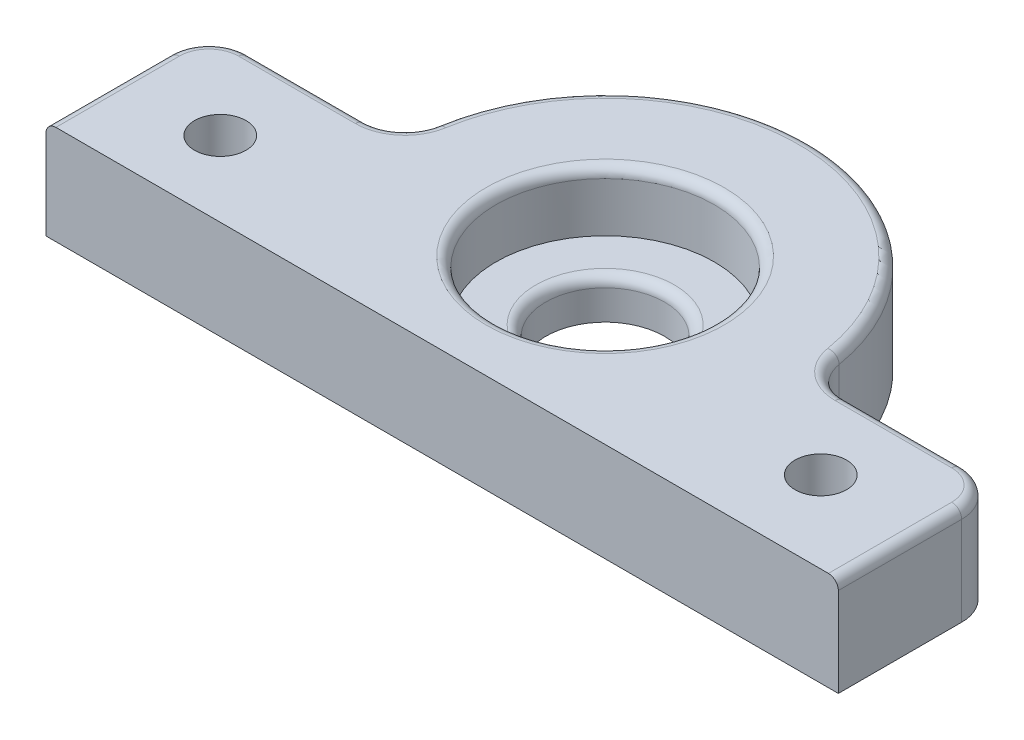
ISO-10303-21;
HEADER;
FILE_DESCRIPTION(('STEP AP214'),'2;1');
FILE_NAME('part.step','',(''),(''),'','','');
FILE_SCHEMA(('AUTOMOTIVE_DESIGN { 1 0 10303 214 1 1 1 1 }'));
ENDSEC;
DATA;
#1=APPLICATION_CONTEXT('core data for automotive mechanical design processes');
#2=APPLICATION_PROTOCOL_DEFINITION('international standard','automotive_design',2000,#1);
#3=PRODUCT_CONTEXT('',#1,'mechanical');
#4=PRODUCT('Part','Part','',(#3));
#5=PRODUCT_RELATED_PRODUCT_CATEGORY('part','',(#4));
#6=PRODUCT_DEFINITION_FORMATION('','',#4);
#7=PRODUCT_DEFINITION_CONTEXT('part definition',#1,'design');
#8=PRODUCT_DEFINITION('design','',#6,#7);
#9=PRODUCT_DEFINITION_SHAPE('','',#8);
#10=(LENGTH_UNIT() NAMED_UNIT(*) SI_UNIT(.MILLI.,.METRE.));
#11=(NAMED_UNIT(*) PLANE_ANGLE_UNIT() SI_UNIT($,.RADIAN.));
#12=(NAMED_UNIT(*) SI_UNIT($,.STERADIAN.) SOLID_ANGLE_UNIT());
#13=UNCERTAINTY_MEASURE_WITH_UNIT(LENGTH_MEASURE(1.E-05),#10,'distance_accuracy_value','');
#14=(GEOMETRIC_REPRESENTATION_CONTEXT(3) GLOBAL_UNCERTAINTY_ASSIGNED_CONTEXT((#13)) GLOBAL_UNIT_ASSIGNED_CONTEXT((#10,
#11,#12)) REPRESENTATION_CONTEXT('',''));
#15=CARTESIAN_POINT('',(0.,0.,0.));
#16=DIRECTION('',(0.,0.,1.));
#17=DIRECTION('',(1.,0.,0.));
#18=AXIS2_PLACEMENT_3D('',#15,#16,#17);
#19=CARTESIAN_POINT('',(0.,10.,0.));
#20=DIRECTION('',(0.,-1.,0.));
#21=DIRECTION('',(0.,0.,-1.));
#22=AXIS2_PLACEMENT_3D('',#19,#20,#21);
#23=CYLINDRICAL_SURFACE('',#22,11.025);
#24=CARTESIAN_POINT('',(0.,9.,0.));
#25=DIRECTION('',(0.,1.,0.));
#26=DIRECTION('',(0.,0.,1.));
#27=AXIS2_PLACEMENT_3D('',#24,#25,#26);
#28=CIRCLE('',#27,11.025);
#29=CARTESIAN_POINT('',(0.,9.,11.025));
#30=VERTEX_POINT('',#29);
#31=EDGE_CURVE('E249',#30,#30,#28,.T.);
#32=ORIENTED_EDGE('',*,*,#31,.T.);
#33=EDGE_LOOP('',(#32));
#34=FACE_BOUND('',#33,.T.);
#35=CARTESIAN_POINT('',(0.,4.,0.));
#36=DIRECTION('',(0.,-1.,0.));
#37=DIRECTION('',(0.,0.,-1.));
#38=AXIS2_PLACEMENT_3D('',#35,#36,#37);
#39=CIRCLE('',#38,11.025);
#40=CARTESIAN_POINT('',(0.,4.,-11.025));
#41=VERTEX_POINT('',#40);
#42=EDGE_CURVE('E162',#41,#41,#39,.T.);
#43=ORIENTED_EDGE('',*,*,#42,.T.);
#44=EDGE_LOOP('',(#43));
#45=FACE_BOUND('',#44,.T.);
#46=ADVANCED_FACE('F36',(#34,#45),#23,.F.);
#47=CARTESIAN_POINT('',(0.,10.,0.));
#48=DIRECTION('',(0.,1.,0.));
#49=DIRECTION('',(0.,0.,1.));
#50=AXIS2_PLACEMENT_3D('',#47,#48,#49);
#51=PLANE('',#50);
#52=CARTESIAN_POINT('',(-29.9966400739153,10.,8.86202444078227));
#53=DIRECTION('',(0.,1.,0.));
#54=DIRECTION('',(0.,0.,1.));
#55=AXIS2_PLACEMENT_3D('',#52,#53,#54);
#56=CIRCLE('',#55,2.6);
#57=CARTESIAN_POINT('',(-29.9966400739153,10.,11.4620244407823));
#58=VERTEX_POINT('',#57);
#59=EDGE_CURVE('E605',#58,#58,#56,.F.);
#60=ORIENTED_EDGE('',*,*,#59,.T.);
#61=EDGE_LOOP('',(#60));
#62=FACE_BOUND('',#61,.T.);
#63=CARTESIAN_POINT('',(30.,10.,8.22706));
#64=DIRECTION('',(0.,1.,0.));
#65=DIRECTION('',(0.,0.,1.));
#66=AXIS2_PLACEMENT_3D('',#63,#64,#65);
#67=CIRCLE('',#66,2.6);
#68=CARTESIAN_POINT('',(30.,10.,10.82706));
#69=VERTEX_POINT('',#68);
#70=EDGE_CURVE('E292',#69,#69,#67,.F.);
#71=ORIENTED_EDGE('',*,*,#70,.T.);
#72=EDGE_LOOP('',(#71));
#73=FACE_BOUND('',#72,.T.);
#74=CARTESIAN_POINT('',(0.,10.,0.));
#75=DIRECTION('',(0.,1.,0.));
#76=DIRECTION('',(0.,0.,1.));
#77=AXIS2_PLACEMENT_3D('',#74,#75,#76);
#78=CIRCLE('',#77,12.025);
#79=CARTESIAN_POINT('',(0.,10.,12.025));
#80=VERTEX_POINT('',#79);
#81=EDGE_CURVE('E228',#80,#80,#78,.F.);
#82=ORIENTED_EDGE('',*,*,#81,.T.);
#83=EDGE_LOOP('',(#82));
#84=FACE_BOUND('',#83,.T.);
#85=DIRECTION('',(1.,0.,0.));
#86=VECTOR('',#85,1.);
#87=CARTESIAN_POINT('',(-40.,10.,16.45412));
#88=LINE('',#87,#86);
#89=CARTESIAN_POINT('',(-39.,10.,16.45412));
#90=VERTEX_POINT('',#89);
#91=CARTESIAN_POINT('',(39.,10.,16.45412));
#92=VERTEX_POINT('',#91);
#93=EDGE_CURVE('E181',#90,#92,#88,.T.);
#94=ORIENTED_EDGE('',*,*,#93,.T.);
#95=DIRECTION('',(0.,0.,-1.));
#96=VECTOR('',#95,1.);
#97=CARTESIAN_POINT('',(39.,10.,4.));
#98=LINE('',#97,#96);
#99=CARTESIAN_POINT('',(39.,10.,4.));
#100=VERTEX_POINT('',#99);
#101=EDGE_CURVE('E225',#92,#100,#98,.T.);
#102=ORIENTED_EDGE('',*,*,#101,.T.);
#103=CARTESIAN_POINT('',(36.,10.,4.));
#104=DIRECTION('',(0.,1.,0.));
#105=DIRECTION('',(0.,0.,1.));
#106=AXIS2_PLACEMENT_3D('',#103,#104,#105);
#107=CIRCLE('',#106,3.);
#108=CARTESIAN_POINT('',(36.,10.,1.));
#109=VERTEX_POINT('',#108);
#110=EDGE_CURVE('E223',#100,#109,#107,.T.);
#111=ORIENTED_EDGE('',*,*,#110,.T.);
#112=DIRECTION('',(-1.,0.,0.));
#113=VECTOR('',#112,1.);
#114=CARTESIAN_POINT('',(24.2219425315147,10.,1.));
#115=LINE('',#114,#113);
#116=CARTESIAN_POINT('',(24.2219425315147,10.,1.));
#117=VERTEX_POINT('',#116);
#118=EDGE_CURVE('E221',#109,#117,#115,.T.);
#119=ORIENTED_EDGE('',*,*,#118,.T.);
#120=CARTESIAN_POINT('',(24.2219425315147,10.,-4.));
#121=DIRECTION('',(0.,1.,0.));
#122=DIRECTION('',(0.,0.,1.));
#123=AXIS2_PLACEMENT_3D('',#120,#121,#122);
#124=CIRCLE('',#123,5.);
#125=CARTESIAN_POINT('',(19.2887566798824,10.,-3.18533604887984));
#126=VERTEX_POINT('',#125);
#127=EDGE_CURVE('E219',#117,#126,#124,.F.);
#128=ORIENTED_EDGE('',*,*,#127,.T.);
#129=CARTESIAN_POINT('',(0.,10.,0.));
#130=DIRECTION('',(0.,1.,0.));
#131=DIRECTION('',(0.,0.,1.));
#132=AXIS2_PLACEMENT_3D('',#129,#130,#131);
#133=CIRCLE('',#132,19.55);
#134=CARTESIAN_POINT('',(-19.2887566798824,10.,-3.18533604887984));
#135=VERTEX_POINT('',#134);
#136=EDGE_CURVE('E217',#126,#135,#133,.T.);
#137=ORIENTED_EDGE('',*,*,#136,.T.);
#138=CARTESIAN_POINT('',(-24.2219425315147,10.,-4.));
#139=DIRECTION('',(0.,1.,0.));
#140=DIRECTION('',(0.,0.,1.));
#141=AXIS2_PLACEMENT_3D('',#138,#139,#140);
#142=CIRCLE('',#141,5.);
#143=CARTESIAN_POINT('',(-24.2219425315147,10.,1.));
#144=VERTEX_POINT('',#143);
#145=EDGE_CURVE('E215',#135,#144,#142,.F.);
#146=ORIENTED_EDGE('',*,*,#145,.T.);
#147=DIRECTION('',(-1.,0.,0.));
#148=VECTOR('',#147,1.);
#149=CARTESIAN_POINT('',(-36.,10.,1.));
#150=LINE('',#149,#148);
#151=CARTESIAN_POINT('',(-36.,10.,1.));
#152=VERTEX_POINT('',#151);
#153=EDGE_CURVE('E213',#144,#152,#150,.T.);
#154=ORIENTED_EDGE('',*,*,#153,.T.);
#155=CARTESIAN_POINT('',(-36.,10.,4.));
#156=DIRECTION('',(0.,1.,0.));
#157=DIRECTION('',(0.,0.,1.));
#158=AXIS2_PLACEMENT_3D('',#155,#156,#157);
#159=CIRCLE('',#158,3.);
#160=CARTESIAN_POINT('',(-39.,10.,4.));
#161=VERTEX_POINT('',#160);
#162=EDGE_CURVE('E211',#152,#161,#159,.T.);
#163=ORIENTED_EDGE('',*,*,#162,.T.);
#164=DIRECTION('',(0.,0.,1.));
#165=VECTOR('',#164,1.);
#166=CARTESIAN_POINT('',(-39.,10.,16.45412));
#167=LINE('',#166,#165);
#168=EDGE_CURVE('E209',#161,#90,#167,.T.);
#169=ORIENTED_EDGE('',*,*,#168,.T.);
#170=EDGE_LOOP('',(#94,#102,#111,#119,#128,#137,#146,#154,#163,#169));
#171=FACE_BOUND('',#170,.T.);
#172=ADVANCED_FACE('F297',(#62,#73,#84,#171),#51,.T.);
#173=CARTESIAN_POINT('',(0.,0.,0.));
#174=DIRECTION('',(0.,1.,0.));
#175=DIRECTION('',(0.,0.,1.));
#176=AXIS2_PLACEMENT_3D('',#173,#174,#175);
#177=PLANE('',#176);
#178=CARTESIAN_POINT('',(-29.9966400739153,0.,8.86202444078227));
#179=DIRECTION('',(0.,-1.,0.));
#180=DIRECTION('',(0.,0.,-1.));
#181=AXIS2_PLACEMENT_3D('',#178,#179,#180);
#182=CIRCLE('',#181,2.6);
#183=CARTESIAN_POINT('',(-29.9966400739153,0.,6.26202444078227));
#184=VERTEX_POINT('',#183);
#185=EDGE_CURVE('E608',#184,#184,#182,.T.);
#186=ORIENTED_EDGE('',*,*,#185,.F.);
#187=EDGE_LOOP('',(#186));
#188=FACE_BOUND('',#187,.T.);
#189=CARTESIAN_POINT('',(30.,0.,8.22706));
#190=DIRECTION('',(0.,-1.,0.));
#191=DIRECTION('',(0.,0.,-1.));
#192=AXIS2_PLACEMENT_3D('',#189,#190,#191);
#193=CIRCLE('',#192,2.6);
#194=CARTESIAN_POINT('',(30.,0.,5.62706));
#195=VERTEX_POINT('',#194);
#196=EDGE_CURVE('E260',#195,#195,#193,.T.);
#197=ORIENTED_EDGE('',*,*,#196,.F.);
#198=EDGE_LOOP('',(#197));
#199=FACE_BOUND('',#198,.T.);
#200=DIRECTION('',(0.,0.,1.));
#201=VECTOR('',#200,1.);
#202=CARTESIAN_POINT('',(-40.,0.,16.45412));
#203=LINE('',#202,#201);
#204=CARTESIAN_POINT('',(-40.,0.,4.));
#205=VERTEX_POINT('',#204);
#206=CARTESIAN_POINT('',(-40.,0.,16.45412));
#207=VERTEX_POINT('',#206);
#208=EDGE_CURVE('E158',#205,#207,#203,.T.);
#209=ORIENTED_EDGE('',*,*,#208,.F.);
#210=CARTESIAN_POINT('',(-36.,0.,4.));
#211=DIRECTION('',(0.,1.,0.));
#212=DIRECTION('',(0.,0.,1.));
#213=AXIS2_PLACEMENT_3D('',#210,#211,#212);
#214=CIRCLE('',#213,4.);
#215=CARTESIAN_POINT('',(-36.,0.,0.));
#216=VERTEX_POINT('',#215);
#217=EDGE_CURVE('E186',#205,#216,#214,.F.);
#218=ORIENTED_EDGE('',*,*,#217,.T.);
#219=DIRECTION('',(-1.,0.,0.));
#220=VECTOR('',#219,1.);
#221=CARTESIAN_POINT('',(-40.,0.,0.));
#222=LINE('',#221,#220);
#223=CARTESIAN_POINT('',(-24.2219425315147,0.,0.));
#224=VERTEX_POINT('',#223);
#225=EDGE_CURVE('E178',#224,#216,#222,.T.);
#226=ORIENTED_EDGE('',*,*,#225,.F.);
#227=CARTESIAN_POINT('',(-24.2219425315147,0.,-4.));
#228=DIRECTION('',(0.,1.,0.));
#229=DIRECTION('',(0.,0.,1.));
#230=AXIS2_PLACEMENT_3D('',#227,#228,#229);
#231=CIRCLE('',#230,4.);
#232=CARTESIAN_POINT('',(-20.2753938502088,0.,-3.34826883910387));
#233=VERTEX_POINT('',#232);
#234=EDGE_CURVE('E205',#224,#233,#231,.T.);
#235=ORIENTED_EDGE('',*,*,#234,.T.);
#236=CARTESIAN_POINT('',(0.,0.,0.));
#237=DIRECTION('',(0.,1.,0.));
#238=DIRECTION('',(0.,0.,1.));
#239=AXIS2_PLACEMENT_3D('',#236,#237,#238);
#240=CIRCLE('',#239,20.55);
#241=CARTESIAN_POINT('',(20.2753938502088,0.,-3.34826883910387));
#242=VERTEX_POINT('',#241);
#243=EDGE_CURVE('E175',#242,#233,#240,.T.);
#244=ORIENTED_EDGE('',*,*,#243,.F.);
#245=CARTESIAN_POINT('',(24.2219425315147,0.,-4.));
#246=DIRECTION('',(0.,1.,0.));
#247=DIRECTION('',(0.,0.,1.));
#248=AXIS2_PLACEMENT_3D('',#245,#246,#247);
#249=CIRCLE('',#248,4.);
#250=CARTESIAN_POINT('',(24.2219425315147,0.,0.));
#251=VERTEX_POINT('',#250);
#252=EDGE_CURVE('E207',#242,#251,#249,.T.);
#253=ORIENTED_EDGE('',*,*,#252,.T.);
#254=DIRECTION('',(-1.,0.,0.));
#255=VECTOR('',#254,1.);
#256=CARTESIAN_POINT('',(40.,0.,0.));
#257=LINE('',#256,#255);
#258=CARTESIAN_POINT('',(36.,0.,0.));
#259=VERTEX_POINT('',#258);
#260=EDGE_CURVE('E169',#259,#251,#257,.T.);
#261=ORIENTED_EDGE('',*,*,#260,.F.);
#262=CARTESIAN_POINT('',(36.,0.,4.));
#263=DIRECTION('',(0.,1.,0.));
#264=DIRECTION('',(0.,0.,1.));
#265=AXIS2_PLACEMENT_3D('',#262,#263,#264);
#266=CIRCLE('',#265,4.);
#267=CARTESIAN_POINT('',(40.,0.,4.));
#268=VERTEX_POINT('',#267);
#269=EDGE_CURVE('E184',#259,#268,#266,.F.);
#270=ORIENTED_EDGE('',*,*,#269,.T.);
#271=DIRECTION('',(0.,0.,-1.));
#272=VECTOR('',#271,1.);
#273=CARTESIAN_POINT('',(40.,0.,16.45412));
#274=LINE('',#273,#272);
#275=CARTESIAN_POINT('',(40.,0.,16.45412));
#276=VERTEX_POINT('',#275);
#277=EDGE_CURVE('E167',#276,#268,#274,.T.);
#278=ORIENTED_EDGE('',*,*,#277,.F.);
#279=DIRECTION('',(1.,0.,0.));
#280=VECTOR('',#279,1.);
#281=CARTESIAN_POINT('',(-40.,0.,16.45412));
#282=LINE('',#281,#280);
#283=EDGE_CURVE('E149',#207,#276,#282,.T.);
#284=ORIENTED_EDGE('',*,*,#283,.F.);
#285=EDGE_LOOP('',(#209,#218,#226,#235,#244,#253,#261,#270,#278,#284));
#286=FACE_BOUND('',#285,.T.);
#287=CARTESIAN_POINT('',(0.,0.,0.));
#288=DIRECTION('',(0.,-1.,0.));
#289=DIRECTION('',(0.,0.,-1.));
#290=AXIS2_PLACEMENT_3D('',#287,#288,#289);
#291=CIRCLE('',#290,6.);
#292=CARTESIAN_POINT('',(0.,0.,-6.));
#293=VERTEX_POINT('',#292);
#294=EDGE_CURVE('E281',#293,#293,#291,.T.);
#295=ORIENTED_EDGE('',*,*,#294,.F.);
#296=EDGE_LOOP('',(#295));
#297=FACE_BOUND('',#296,.T.);
#298=ADVANCED_FACE('F164',(#188,#199,#286,#297),#177,.F.);
#299=CARTESIAN_POINT('',(-40.,10.,16.45412));
#300=DIRECTION('',(1.,0.,0.));
#301=DIRECTION('',(0.,0.,-1.));
#302=AXIS2_PLACEMENT_3D('',#299,#300,#301);
#303=PLANE('',#302);
#304=DIRECTION('',(0.,-1.,0.));
#305=VECTOR('',#304,1.);
#306=CARTESIAN_POINT('',(-40.,10.,16.45412));
#307=LINE('',#306,#305);
#308=CARTESIAN_POINT('',(-40.,9.,16.45412));
#309=VERTEX_POINT('',#308);
#310=EDGE_CURVE('E144',#309,#207,#307,.T.);
#311=ORIENTED_EDGE('',*,*,#310,.F.);
#312=DIRECTION('',(0.,0.,1.));
#313=VECTOR('',#312,1.);
#314=CARTESIAN_POINT('',(-40.,9.,4.));
#315=LINE('',#314,#313);
#316=CARTESIAN_POINT('',(-40.,9.,4.));
#317=VERTEX_POINT('',#316);
#318=EDGE_CURVE('E11',#309,#317,#315,.F.);
#319=ORIENTED_EDGE('',*,*,#318,.T.);
#320=DIRECTION('',(0.,-1.,0.));
#321=VECTOR('',#320,1.);
#322=CARTESIAN_POINT('',(-40.,10.,4.));
#323=LINE('',#322,#321);
#324=EDGE_CURVE('E154',#317,#205,#323,.T.);
#325=ORIENTED_EDGE('',*,*,#324,.T.);
#326=ORIENTED_EDGE('',*,*,#208,.T.);
#327=EDGE_LOOP('',(#311,#319,#325,#326));
#328=FACE_BOUND('',#327,.T.);
#329=ADVANCED_FACE('F159',(#328),#303,.F.);
#330=CARTESIAN_POINT('',(-40.,10.,16.45412));
#331=DIRECTION('',(0.,0.,-1.));
#332=DIRECTION('',(-1.,0.,0.));
#333=AXIS2_PLACEMENT_3D('',#330,#331,#332);
#334=PLANE('',#333);
#335=DIRECTION('',(0.,-1.,0.));
#336=VECTOR('',#335,1.);
#337=CARTESIAN_POINT('',(40.,10.,16.45412));
#338=LINE('',#337,#336);
#339=CARTESIAN_POINT('',(40.,9.,16.45412));
#340=VERTEX_POINT('',#339);
#341=EDGE_CURVE('E155',#340,#276,#338,.T.);
#342=ORIENTED_EDGE('',*,*,#341,.F.);
#343=CARTESIAN_POINT('',(39.,9.,16.45412));
#344=DIRECTION('',(0.,0.,-1.));
#345=DIRECTION('',(-1.,0.,0.));
#346=AXIS2_PLACEMENT_3D('',#343,#344,#345);
#347=CIRCLE('',#346,1.);
#348=EDGE_CURVE('E234',#340,#92,#347,.F.);
#349=ORIENTED_EDGE('',*,*,#348,.T.);
#350=ORIENTED_EDGE('',*,*,#93,.F.);
#351=CARTESIAN_POINT('',(-39.,9.,16.45412));
#352=DIRECTION('',(0.,0.,-1.));
#353=DIRECTION('',(-1.,0.,0.));
#354=AXIS2_PLACEMENT_3D('',#351,#352,#353);
#355=CIRCLE('',#354,1.);
#356=EDGE_CURVE('E153',#90,#309,#355,.F.);
#357=ORIENTED_EDGE('',*,*,#356,.T.);
#358=ORIENTED_EDGE('',*,*,#310,.T.);
#359=ORIENTED_EDGE('',*,*,#283,.T.);
#360=EDGE_LOOP('',(#342,#349,#350,#357,#358,#359));
#361=FACE_BOUND('',#360,.T.);
#362=ADVANCED_FACE('F147',(#361),#334,.F.);
#363=CARTESIAN_POINT('',(40.,10.,16.45412));
#364=DIRECTION('',(-1.,0.,0.));
#365=DIRECTION('',(0.,0.,1.));
#366=AXIS2_PLACEMENT_3D('',#363,#364,#365);
#367=PLANE('',#366);
#368=DIRECTION('',(0.,-1.,0.));
#369=VECTOR('',#368,1.);
#370=CARTESIAN_POINT('',(40.,10.,4.));
#371=LINE('',#370,#369);
#372=CARTESIAN_POINT('',(40.,9.,4.));
#373=VERTEX_POINT('',#372);
#374=EDGE_CURVE('E202',#268,#373,#371,.F.);
#375=ORIENTED_EDGE('',*,*,#374,.T.);
#376=DIRECTION('',(0.,0.,-1.));
#377=VECTOR('',#376,1.);
#378=CARTESIAN_POINT('',(40.,9.,16.45412));
#379=LINE('',#378,#377);
#380=EDGE_CURVE('E231',#373,#340,#379,.F.);
#381=ORIENTED_EDGE('',*,*,#380,.T.);
#382=ORIENTED_EDGE('',*,*,#341,.T.);
#383=ORIENTED_EDGE('',*,*,#277,.T.);
#384=EDGE_LOOP('',(#375,#381,#382,#383));
#385=FACE_BOUND('',#384,.T.);
#386=ADVANCED_FACE('F377',(#385),#367,.F.);
#387=CARTESIAN_POINT('',(40.,10.,0.));
#388=DIRECTION('',(0.,0.,1.));
#389=DIRECTION('',(1.,0.,0.));
#390=AXIS2_PLACEMENT_3D('',#387,#388,#389);
#391=PLANE('',#390);
#392=DIRECTION('',(0.,1.,0.));
#393=VECTOR('',#392,1.);
#394=CARTESIAN_POINT('',(24.2219425315147,10.,0.));
#395=LINE('',#394,#393);
#396=CARTESIAN_POINT('',(24.2219425315147,9.,0.));
#397=VERTEX_POINT('',#396);
#398=EDGE_CURVE('E199',#251,#397,#395,.T.);
#399=ORIENTED_EDGE('',*,*,#398,.T.);
#400=DIRECTION('',(-1.,0.,0.));
#401=VECTOR('',#400,1.);
#402=CARTESIAN_POINT('',(36.,9.,0.));
#403=LINE('',#402,#401);
#404=CARTESIAN_POINT('',(36.,9.,0.));
#405=VERTEX_POINT('',#404);
#406=EDGE_CURVE('E238',#397,#405,#403,.F.);
#407=ORIENTED_EDGE('',*,*,#406,.T.);
#408=DIRECTION('',(0.,-1.,0.));
#409=VECTOR('',#408,1.);
#410=CARTESIAN_POINT('',(36.,10.,0.));
#411=LINE('',#410,#409);
#412=EDGE_CURVE('E197',#405,#259,#411,.T.);
#413=ORIENTED_EDGE('',*,*,#412,.T.);
#414=ORIENTED_EDGE('',*,*,#260,.T.);
#415=EDGE_LOOP('',(#399,#407,#413,#414));
#416=FACE_BOUND('',#415,.T.);
#417=ADVANCED_FACE('F373',(#416),#391,.F.);
#418=CARTESIAN_POINT('',(0.,10.,0.));
#419=DIRECTION('',(0.,-1.,0.));
#420=DIRECTION('',(0.,0.,-1.));
#421=AXIS2_PLACEMENT_3D('',#418,#419,#420);
#422=CYLINDRICAL_SURFACE('',#421,20.55);
#423=DIRECTION('',(0.,-1.,0.));
#424=VECTOR('',#423,1.);
#425=CARTESIAN_POINT('',(-20.2753938502088,10.,-3.34826883910387));
#426=LINE('',#425,#424);
#427=CARTESIAN_POINT('',(-20.2753938502088,9.,-3.34826883910387));
#428=VERTEX_POINT('',#427);
#429=EDGE_CURVE('E194',#233,#428,#426,.F.);
#430=ORIENTED_EDGE('',*,*,#429,.T.);
#431=CARTESIAN_POINT('',(0.,9.,0.));
#432=DIRECTION('',(0.,1.,0.));
#433=DIRECTION('',(0.,0.,1.));
#434=AXIS2_PLACEMENT_3D('',#431,#432,#433);
#435=CIRCLE('',#434,20.55);
#436=CARTESIAN_POINT('',(20.2753938502088,9.,-3.34826883910387));
#437=VERTEX_POINT('',#436);
#438=EDGE_CURVE('E242',#428,#437,#435,.F.);
#439=ORIENTED_EDGE('',*,*,#438,.T.);
#440=DIRECTION('',(0.,-1.,0.));
#441=VECTOR('',#440,1.);
#442=CARTESIAN_POINT('',(20.2753938502088,10.,-3.34826883910387));
#443=LINE('',#442,#441);
#444=EDGE_CURVE('E192',#437,#242,#443,.T.);
#445=ORIENTED_EDGE('',*,*,#444,.T.);
#446=ORIENTED_EDGE('',*,*,#243,.T.);
#447=EDGE_LOOP('',(#430,#439,#445,#446));
#448=FACE_BOUND('',#447,.T.);
#449=ADVANCED_FACE('F370',(#448),#422,.T.);
#450=CARTESIAN_POINT('',(-40.,10.,0.));
#451=DIRECTION('',(0.,0.,1.));
#452=DIRECTION('',(1.,0.,0.));
#453=AXIS2_PLACEMENT_3D('',#450,#451,#452);
#454=PLANE('',#453);
#455=DIRECTION('',(0.,-1.,0.));
#456=VECTOR('',#455,1.);
#457=CARTESIAN_POINT('',(-36.,10.,0.));
#458=LINE('',#457,#456);
#459=CARTESIAN_POINT('',(-36.,9.,0.));
#460=VERTEX_POINT('',#459);
#461=EDGE_CURVE('E190',#216,#460,#458,.F.);
#462=ORIENTED_EDGE('',*,*,#461,.T.);
#463=DIRECTION('',(-1.,0.,0.));
#464=VECTOR('',#463,1.);
#465=CARTESIAN_POINT('',(-24.2219425315147,9.,0.));
#466=LINE('',#465,#464);
#467=CARTESIAN_POINT('',(-24.2219425315147,9.,0.));
#468=VERTEX_POINT('',#467);
#469=EDGE_CURVE('E246',#460,#468,#466,.F.);
#470=ORIENTED_EDGE('',*,*,#469,.T.);
#471=DIRECTION('',(0.,1.,0.));
#472=VECTOR('',#471,1.);
#473=CARTESIAN_POINT('',(-24.2219425315147,0.,0.));
#474=LINE('',#473,#472);
#475=EDGE_CURVE('E188',#468,#224,#474,.F.);
#476=ORIENTED_EDGE('',*,*,#475,.T.);
#477=ORIENTED_EDGE('',*,*,#225,.T.);
#478=EDGE_LOOP('',(#462,#470,#476,#477));
#479=FACE_BOUND('',#478,.T.);
#480=ADVANCED_FACE('F332',(#479),#454,.F.);
#481=CARTESIAN_POINT('',(0.,4.,0.));
#482=DIRECTION('',(0.,-1.,0.));
#483=DIRECTION('',(0.,0.,-1.));
#484=AXIS2_PLACEMENT_3D('',#481,#482,#483);
#485=PLANE('',#484);
#486=CARTESIAN_POINT('',(0.,4.,0.));
#487=DIRECTION('',(0.,-1.,0.));
#488=DIRECTION('',(0.,0.,-1.));
#489=AXIS2_PLACEMENT_3D('',#486,#487,#488);
#490=CIRCLE('',#489,7.);
#491=CARTESIAN_POINT('',(0.,4.,-7.));
#492=VERTEX_POINT('',#491);
#493=EDGE_CURVE('E252',#492,#492,#490,.T.);
#494=ORIENTED_EDGE('',*,*,#493,.T.);
#495=EDGE_LOOP('',(#494));
#496=FACE_BOUND('',#495,.T.);
#497=ORIENTED_EDGE('',*,*,#42,.F.);
#498=EDGE_LOOP('',(#497));
#499=FACE_BOUND('',#498,.T.);
#500=ADVANCED_FACE('F362',(#496,#499),#485,.F.);
#501=CARTESIAN_POINT('',(0.,4.,0.));
#502=DIRECTION('',(0.,-1.,0.));
#503=DIRECTION('',(0.,0.,-1.));
#504=AXIS2_PLACEMENT_3D('',#501,#502,#503);
#505=CYLINDRICAL_SURFACE('',#504,6.);
#506=CARTESIAN_POINT('',(0.,3.,0.));
#507=DIRECTION('',(0.,-1.,0.));
#508=DIRECTION('',(0.,0.,-1.));
#509=AXIS2_PLACEMENT_3D('',#506,#507,#508);
#510=CIRCLE('',#509,6.);
#511=CARTESIAN_POINT('',(0.,3.,-6.));
#512=VERTEX_POINT('',#511);
#513=EDGE_CURVE('E45',#512,#512,#510,.F.);
#514=ORIENTED_EDGE('',*,*,#513,.T.);
#515=EDGE_LOOP('',(#514));
#516=FACE_BOUND('',#515,.T.);
#517=ORIENTED_EDGE('',*,*,#294,.T.);
#518=EDGE_LOOP('',(#517));
#519=FACE_BOUND('',#518,.T.);
#520=ADVANCED_FACE('F388',(#516,#519),#505,.F.);
#521=CARTESIAN_POINT('',(-36.,10.,4.));
#522=DIRECTION('',(0.,-1.,0.));
#523=DIRECTION('',(0.,0.,-1.));
#524=AXIS2_PLACEMENT_3D('',#521,#522,#523);
#525=CYLINDRICAL_SURFACE('',#524,4.);
#526=ORIENTED_EDGE('',*,*,#324,.F.);
#527=CARTESIAN_POINT('',(-36.,9.,4.));
#528=DIRECTION('',(0.,1.,0.));
#529=DIRECTION('',(0.,0.,1.));
#530=AXIS2_PLACEMENT_3D('',#527,#528,#529);
#531=CIRCLE('',#530,4.);
#532=EDGE_CURVE('E58',#317,#460,#531,.F.);
#533=ORIENTED_EDGE('',*,*,#532,.T.);
#534=ORIENTED_EDGE('',*,*,#461,.F.);
#535=ORIENTED_EDGE('',*,*,#217,.F.);
#536=EDGE_LOOP('',(#526,#533,#534,#535));
#537=FACE_BOUND('',#536,.T.);
#538=ADVANCED_FACE('F339',(#537),#525,.T.);
#539=CARTESIAN_POINT('',(-24.2219425315147,10.,-4.));
#540=DIRECTION('',(0.,-1.,0.));
#541=DIRECTION('',(0.,0.,-1.));
#542=AXIS2_PLACEMENT_3D('',#539,#540,#541);
#543=CYLINDRICAL_SURFACE('',#542,4.);
#544=ORIENTED_EDGE('',*,*,#475,.F.);
#545=CARTESIAN_POINT('',(-24.2219425315147,9.,-4.));
#546=DIRECTION('',(0.,1.,0.));
#547=DIRECTION('',(0.,0.,1.));
#548=AXIS2_PLACEMENT_3D('',#545,#546,#547);
#549=CIRCLE('',#548,4.);
#550=EDGE_CURVE('E244',#468,#428,#549,.T.);
#551=ORIENTED_EDGE('',*,*,#550,.T.);
#552=ORIENTED_EDGE('',*,*,#429,.F.);
#553=ORIENTED_EDGE('',*,*,#234,.F.);
#554=EDGE_LOOP('',(#544,#551,#552,#553));
#555=FACE_BOUND('',#554,.T.);
#556=ADVANCED_FACE('F335',(#555),#543,.F.);
#557=CARTESIAN_POINT('',(24.2219425315147,10.,-4.));
#558=DIRECTION('',(0.,-1.,0.));
#559=DIRECTION('',(0.,0.,-1.));
#560=AXIS2_PLACEMENT_3D('',#557,#558,#559);
#561=CYLINDRICAL_SURFACE('',#560,4.);
#562=ORIENTED_EDGE('',*,*,#444,.F.);
#563=CARTESIAN_POINT('',(24.2219425315147,9.,-4.));
#564=DIRECTION('',(0.,1.,0.));
#565=DIRECTION('',(0.,0.,1.));
#566=AXIS2_PLACEMENT_3D('',#563,#564,#565);
#567=CIRCLE('',#566,4.);
#568=EDGE_CURVE('E240',#437,#397,#567,.T.);
#569=ORIENTED_EDGE('',*,*,#568,.T.);
#570=ORIENTED_EDGE('',*,*,#398,.F.);
#571=ORIENTED_EDGE('',*,*,#252,.F.);
#572=EDGE_LOOP('',(#562,#569,#570,#571));
#573=FACE_BOUND('',#572,.T.);
#574=ADVANCED_FACE('F391',(#573),#561,.F.);
#575=CARTESIAN_POINT('',(36.,10.,4.));
#576=DIRECTION('',(0.,-1.,0.));
#577=DIRECTION('',(0.,0.,-1.));
#578=AXIS2_PLACEMENT_3D('',#575,#576,#577);
#579=CYLINDRICAL_SURFACE('',#578,4.);
#580=ORIENTED_EDGE('',*,*,#412,.F.);
#581=CARTESIAN_POINT('',(36.,9.,4.));
#582=DIRECTION('',(0.,1.,0.));
#583=DIRECTION('',(0.,0.,1.));
#584=AXIS2_PLACEMENT_3D('',#581,#582,#583);
#585=CIRCLE('',#584,4.);
#586=EDGE_CURVE('E236',#405,#373,#585,.F.);
#587=ORIENTED_EDGE('',*,*,#586,.T.);
#588=ORIENTED_EDGE('',*,*,#374,.F.);
#589=ORIENTED_EDGE('',*,*,#269,.F.);
#590=EDGE_LOOP('',(#580,#587,#588,#589));
#591=FACE_BOUND('',#590,.T.);
#592=ADVANCED_FACE('F350',(#591),#579,.T.);
#593=CARTESIAN_POINT('',(-39.,9.,0.));
#594=DIRECTION('',(0.,0.,-1.));
#595=DIRECTION('',(-1.,0.,0.));
#596=AXIS2_PLACEMENT_3D('',#593,#594,#595);
#597=CYLINDRICAL_SURFACE('',#596,1.);
#598=ORIENTED_EDGE('',*,*,#356,.F.);
#599=ORIENTED_EDGE('',*,*,#168,.F.);
#600=CARTESIAN_POINT('',(-39.,9.,4.));
#601=DIRECTION('',(0.,0.,-1.));
#602=DIRECTION('',(-1.,0.,0.));
#603=AXIS2_PLACEMENT_3D('',#600,#601,#602);
#604=CIRCLE('',#603,1.);
#605=EDGE_CURVE('E40',#317,#161,#604,.T.);
#606=ORIENTED_EDGE('',*,*,#605,.F.);
#607=ORIENTED_EDGE('',*,*,#318,.F.);
#608=EDGE_LOOP('',(#598,#599,#606,#607));
#609=FACE_BOUND('',#608,.T.);
#610=ADVANCED_FACE('F341',(#609),#597,.T.);
#611=CARTESIAN_POINT('',(-36.,9.,4.));
#612=DIRECTION('',(0.,1.,0.));
#613=DIRECTION('',(0.,0.,1.));
#614=AXIS2_PLACEMENT_3D('',#611,#612,#613);
#615=TOROIDAL_SURFACE('',#614,3.,1.);
#616=ORIENTED_EDGE('',*,*,#605,.T.);
#617=ORIENTED_EDGE('',*,*,#162,.F.);
#618=CARTESIAN_POINT('',(-36.,9.,1.));
#619=DIRECTION('',(1.,0.,0.));
#620=DIRECTION('',(0.,0.,-1.));
#621=AXIS2_PLACEMENT_3D('',#618,#619,#620);
#622=CIRCLE('',#621,1.);
#623=EDGE_CURVE('E274',#460,#152,#622,.T.);
#624=ORIENTED_EDGE('',*,*,#623,.F.);
#625=ORIENTED_EDGE('',*,*,#532,.F.);
#626=EDGE_LOOP('',(#616,#617,#624,#625));
#627=FACE_BOUND('',#626,.T.);
#628=ADVANCED_FACE('F342',(#627),#615,.T.);
#629=CARTESIAN_POINT('',(0.,9.,1.));
#630=DIRECTION('',(1.,0.,0.));
#631=DIRECTION('',(0.,0.,-1.));
#632=AXIS2_PLACEMENT_3D('',#629,#630,#631);
#633=CYLINDRICAL_SURFACE('',#632,1.);
#634=ORIENTED_EDGE('',*,*,#623,.T.);
#635=ORIENTED_EDGE('',*,*,#153,.F.);
#636=CARTESIAN_POINT('',(-24.2219425315147,9.,1.));
#637=DIRECTION('',(1.,0.,0.));
#638=DIRECTION('',(0.,0.,-1.));
#639=AXIS2_PLACEMENT_3D('',#636,#637,#638);
#640=CIRCLE('',#639,1.);
#641=EDGE_CURVE('E272',#468,#144,#640,.T.);
#642=ORIENTED_EDGE('',*,*,#641,.F.);
#643=ORIENTED_EDGE('',*,*,#469,.F.);
#644=EDGE_LOOP('',(#634,#635,#642,#643));
#645=FACE_BOUND('',#644,.T.);
#646=ADVANCED_FACE('F329',(#645),#633,.T.);
#647=CARTESIAN_POINT('',(-24.2219425315147,9.,-4.));
#648=DIRECTION('',(0.,1.,0.));
#649=DIRECTION('',(0.,0.,1.));
#650=AXIS2_PLACEMENT_3D('',#647,#648,#649);
#651=TOROIDAL_SURFACE('',#650,5.,1.);
#652=ORIENTED_EDGE('',*,*,#641,.T.);
#653=ORIENTED_EDGE('',*,*,#145,.F.);
#654=CARTESIAN_POINT('',(-19.2887566798824,9.,-3.18533604887984));
#655=DIRECTION('',(0.162932790224033,0.,-0.986637170326464));
#656=DIRECTION('',(-0.986637170326464,0.,-0.162932790224033));
#657=AXIS2_PLACEMENT_3D('',#654,#655,#656);
#658=CIRCLE('',#657,1.);
#659=EDGE_CURVE('E269',#428,#135,#658,.T.);
#660=ORIENTED_EDGE('',*,*,#659,.F.);
#661=ORIENTED_EDGE('',*,*,#550,.F.);
#662=EDGE_LOOP('',(#652,#653,#660,#661));
#663=FACE_BOUND('',#662,.T.);
#664=ADVANCED_FACE('F327',(#663),#651,.T.);
#665=CARTESIAN_POINT('',(0.,9.,0.));
#666=DIRECTION('',(0.,1.,0.));
#667=DIRECTION('',(0.,0.,1.));
#668=AXIS2_PLACEMENT_3D('',#665,#666,#667);
#669=TOROIDAL_SURFACE('',#668,19.55,1.);
#670=ORIENTED_EDGE('',*,*,#659,.T.);
#671=ORIENTED_EDGE('',*,*,#136,.F.);
#672=CARTESIAN_POINT('',(19.2887566798824,9.,-3.18533604887984));
#673=DIRECTION('',(0.162932790224033,0.,0.986637170326464));
#674=DIRECTION('',(0.986637170326464,0.,-0.162932790224033));
#675=AXIS2_PLACEMENT_3D('',#672,#673,#674);
#676=CIRCLE('',#675,1.);
#677=EDGE_CURVE('E266',#437,#126,#676,.T.);
#678=ORIENTED_EDGE('',*,*,#677,.F.);
#679=ORIENTED_EDGE('',*,*,#438,.F.);
#680=EDGE_LOOP('',(#670,#671,#678,#679));
#681=FACE_BOUND('',#680,.T.);
#682=ADVANCED_FACE('F322',(#681),#669,.T.);
#683=CARTESIAN_POINT('',(24.2219425315147,9.,-4.));
#684=DIRECTION('',(0.,1.,0.));
#685=DIRECTION('',(0.,0.,1.));
#686=AXIS2_PLACEMENT_3D('',#683,#684,#685);
#687=TOROIDAL_SURFACE('',#686,5.,1.);
#688=ORIENTED_EDGE('',*,*,#677,.T.);
#689=ORIENTED_EDGE('',*,*,#127,.F.);
#690=CARTESIAN_POINT('',(24.2219425315147,9.,1.));
#691=DIRECTION('',(1.,0.,0.));
#692=DIRECTION('',(0.,0.,-1.));
#693=AXIS2_PLACEMENT_3D('',#690,#691,#692);
#694=CIRCLE('',#693,1.);
#695=EDGE_CURVE('E263',#397,#117,#694,.T.);
#696=ORIENTED_EDGE('',*,*,#695,.F.);
#697=ORIENTED_EDGE('',*,*,#568,.F.);
#698=EDGE_LOOP('',(#688,#689,#696,#697));
#699=FACE_BOUND('',#698,.T.);
#700=ADVANCED_FACE('F317',(#699),#687,.T.);
#701=CARTESIAN_POINT('',(0.,9.,1.));
#702=DIRECTION('',(1.,0.,0.));
#703=DIRECTION('',(0.,0.,-1.));
#704=AXIS2_PLACEMENT_3D('',#701,#702,#703);
#705=CYLINDRICAL_SURFACE('',#704,1.);
#706=ORIENTED_EDGE('',*,*,#695,.T.);
#707=ORIENTED_EDGE('',*,*,#118,.F.);
#708=CARTESIAN_POINT('',(36.,9.,1.));
#709=DIRECTION('',(1.,0.,0.));
#710=DIRECTION('',(0.,0.,-1.));
#711=AXIS2_PLACEMENT_3D('',#708,#709,#710);
#712=CIRCLE('',#711,1.);
#713=EDGE_CURVE('E259',#405,#109,#712,.T.);
#714=ORIENTED_EDGE('',*,*,#713,.F.);
#715=ORIENTED_EDGE('',*,*,#406,.F.);
#716=EDGE_LOOP('',(#706,#707,#714,#715));
#717=FACE_BOUND('',#716,.T.);
#718=ADVANCED_FACE('F312',(#717),#705,.T.);
#719=CARTESIAN_POINT('',(36.,9.,4.));
#720=DIRECTION('',(0.,1.,0.));
#721=DIRECTION('',(0.,0.,1.));
#722=AXIS2_PLACEMENT_3D('',#719,#720,#721);
#723=TOROIDAL_SURFACE('',#722,3.,1.);
#724=ORIENTED_EDGE('',*,*,#713,.T.);
#725=ORIENTED_EDGE('',*,*,#110,.F.);
#726=CARTESIAN_POINT('',(39.,9.,4.));
#727=DIRECTION('',(0.,0.,1.));
#728=DIRECTION('',(1.,0.,0.));
#729=AXIS2_PLACEMENT_3D('',#726,#727,#728);
#730=CIRCLE('',#729,1.);
#731=EDGE_CURVE('E257',#373,#100,#730,.T.);
#732=ORIENTED_EDGE('',*,*,#731,.F.);
#733=ORIENTED_EDGE('',*,*,#586,.F.);
#734=EDGE_LOOP('',(#724,#725,#732,#733));
#735=FACE_BOUND('',#734,.T.);
#736=ADVANCED_FACE('F307',(#735),#723,.T.);
#737=CARTESIAN_POINT('',(39.,9.,0.));
#738=DIRECTION('',(0.,0.,1.));
#739=DIRECTION('',(1.,0.,0.));
#740=AXIS2_PLACEMENT_3D('',#737,#738,#739);
#741=CYLINDRICAL_SURFACE('',#740,1.);
#742=ORIENTED_EDGE('',*,*,#348,.F.);
#743=ORIENTED_EDGE('',*,*,#380,.F.);
#744=ORIENTED_EDGE('',*,*,#731,.T.);
#745=ORIENTED_EDGE('',*,*,#101,.F.);
#746=EDGE_LOOP('',(#742,#743,#744,#745));
#747=FACE_BOUND('',#746,.T.);
#748=ADVANCED_FACE('F301',(#747),#741,.T.);
#749=CARTESIAN_POINT('',(0.,9.,0.));
#750=DIRECTION('',(0.,1.,0.));
#751=DIRECTION('',(0.,0.,1.));
#752=AXIS2_PLACEMENT_3D('',#749,#750,#751);
#753=TOROIDAL_SURFACE('',#752,12.025,1.);
#754=ORIENTED_EDGE('',*,*,#81,.F.);
#755=EDGE_LOOP('',(#754));
#756=FACE_BOUND('',#755,.T.);
#757=ORIENTED_EDGE('',*,*,#31,.F.);
#758=EDGE_LOOP('',(#757));
#759=FACE_BOUND('',#758,.T.);
#760=ADVANCED_FACE('F400',(#756,#759),#753,.T.);
#761=CARTESIAN_POINT('',(0.,3.,0.));
#762=DIRECTION('',(0.,-1.,0.));
#763=DIRECTION('',(0.,0.,-1.));
#764=AXIS2_PLACEMENT_3D('',#761,#762,#763);
#765=TOROIDAL_SURFACE('',#764,7.,1.);
#766=ORIENTED_EDGE('',*,*,#513,.F.);
#767=EDGE_LOOP('',(#766));
#768=FACE_BOUND('',#767,.T.);
#769=ORIENTED_EDGE('',*,*,#493,.F.);
#770=EDGE_LOOP('',(#769));
#771=FACE_BOUND('',#770,.T.);
#772=ADVANCED_FACE('F38',(#768,#771),#765,.T.);
#773=CARTESIAN_POINT('',(30.,10.001,8.22706));
#774=DIRECTION('',(0.,-1.,0.));
#775=DIRECTION('',(0.,0.,-1.));
#776=AXIS2_PLACEMENT_3D('',#773,#774,#775);
#777=CYLINDRICAL_SURFACE('',#776,2.6);
#778=ORIENTED_EDGE('',*,*,#70,.F.);
#779=EDGE_LOOP('',(#778));
#780=FACE_BOUND('',#779,.T.);
#781=ORIENTED_EDGE('',*,*,#196,.T.);
#782=EDGE_LOOP('',(#781));
#783=FACE_BOUND('',#782,.T.);
#784=ADVANCED_FACE('F446',(#780,#783),#777,.F.);
#785=CARTESIAN_POINT('',(-29.9966400739153,10.001,8.86202444078227));
#786=DIRECTION('',(0.,-1.,0.));
#787=DIRECTION('',(0.,0.,-1.));
#788=AXIS2_PLACEMENT_3D('',#785,#786,#787);
#789=CYLINDRICAL_SURFACE('',#788,2.6);
#790=ORIENTED_EDGE('',*,*,#59,.F.);
#791=EDGE_LOOP('',(#790));
#792=FACE_BOUND('',#791,.T.);
#793=ORIENTED_EDGE('',*,*,#185,.T.);
#794=EDGE_LOOP('',(#793));
#795=FACE_BOUND('',#794,.T.);
#796=ADVANCED_FACE('F454',(#792,#795),#789,.F.);
#797=CLOSED_SHELL('',(#46,#172,#298,#329,#362,#386,#417,#449,#480,#500,#520,#538,#556,#574,#592,
#610,#628,#646,#664,#682,#700,#718,#736,#748,#760,#772,#784,#796));
#798=MANIFOLD_SOLID_BREP('B2',#797);
#799=ADVANCED_BREP_SHAPE_REPRESENTATION('',(#18,#798),#14);
#800=SHAPE_DEFINITION_REPRESENTATION(#9,#799);
ENDSEC;
END-ISO-10303-21;
